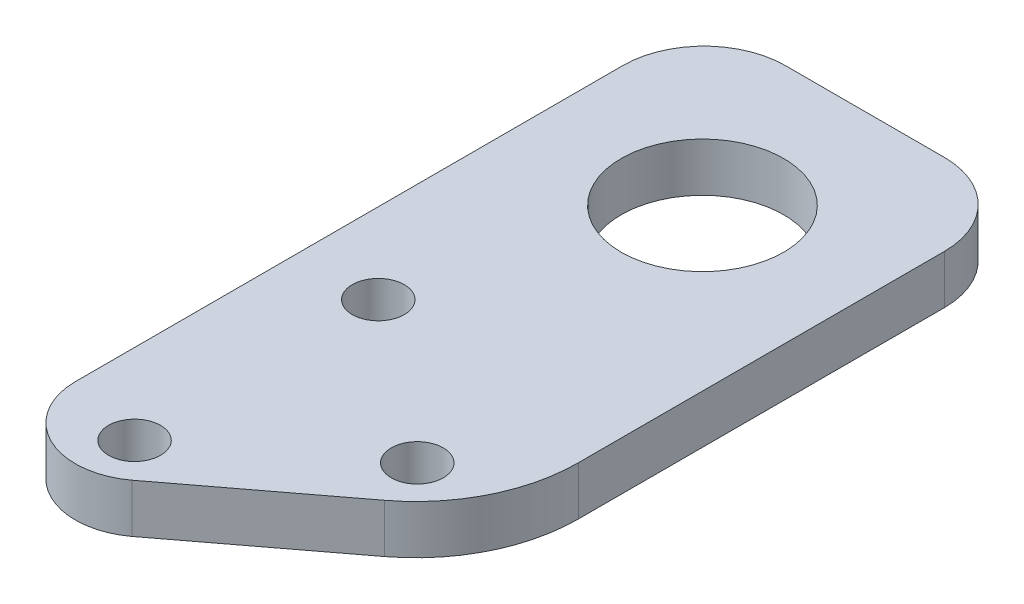
ISO-10303-21;
HEADER;
FILE_DESCRIPTION(('STEP AP214'),'2;1');
FILE_NAME('part.step','',(''),(''),'','','');
FILE_SCHEMA(('AUTOMOTIVE_DESIGN { 1 0 10303 214 1 1 1 1 }'));
ENDSEC;
DATA;
#1=APPLICATION_CONTEXT('core data for automotive mechanical design processes');
#2=APPLICATION_PROTOCOL_DEFINITION('international standard','automotive_design',2000,#1);
#3=PRODUCT_CONTEXT('',#1,'mechanical');
#4=PRODUCT('Part','Part','',(#3));
#5=PRODUCT_RELATED_PRODUCT_CATEGORY('part','',(#4));
#6=PRODUCT_DEFINITION_FORMATION('','',#4);
#7=PRODUCT_DEFINITION_CONTEXT('part definition',#1,'design');
#8=PRODUCT_DEFINITION('design','',#6,#7);
#9=PRODUCT_DEFINITION_SHAPE('','',#8);
#10=(LENGTH_UNIT() NAMED_UNIT(*) SI_UNIT(.MILLI.,.METRE.));
#11=(NAMED_UNIT(*) PLANE_ANGLE_UNIT() SI_UNIT($,.RADIAN.));
#12=(NAMED_UNIT(*) SI_UNIT($,.STERADIAN.) SOLID_ANGLE_UNIT());
#13=UNCERTAINTY_MEASURE_WITH_UNIT(LENGTH_MEASURE(1.E-05),#10,'distance_accuracy_value','');
#14=(GEOMETRIC_REPRESENTATION_CONTEXT(3) GLOBAL_UNCERTAINTY_ASSIGNED_CONTEXT((#13)) GLOBAL_UNIT_ASSIGNED_CONTEXT((#10,
#11,#12)) REPRESENTATION_CONTEXT('',''));
#15=CARTESIAN_POINT('',(0.,0.,0.));
#16=DIRECTION('',(0.,0.,1.));
#17=DIRECTION('',(1.,0.,0.));
#18=AXIS2_PLACEMENT_3D('',#15,#16,#17);
#19=CARTESIAN_POINT('',(-5.52258239011669,3.,6.19220157606207));
#20=DIRECTION('',(0.,1.,0.));
#21=DIRECTION('',(0.,0.,1.));
#22=AXIS2_PLACEMENT_3D('',#19,#20,#21);
#23=PLANE('',#22);
#24=CARTESIAN_POINT('',(4.95,3.,0.));
#25=DIRECTION('',(0.,1.,0.));
#26=DIRECTION('',(0.,0.,1.));
#27=AXIS2_PLACEMENT_3D('',#24,#25,#26);
#28=CIRCLE('',#27,1.6);
#29=CARTESIAN_POINT('',(4.95,3.,1.6));
#30=VERTEX_POINT('',#29);
#31=EDGE_CURVE('E223',#30,#30,#28,.T.);
#32=ORIENTED_EDGE('',*,*,#31,.F.);
#33=EDGE_LOOP('',(#32));
#34=FACE_BOUND('',#33,.T.);
#35=CARTESIAN_POINT('',(-4.95,3.,-7.5));
#36=DIRECTION('',(0.,1.,0.));
#37=DIRECTION('',(0.,0.,1.));
#38=AXIS2_PLACEMENT_3D('',#35,#36,#37);
#39=CIRCLE('',#38,1.6);
#40=CARTESIAN_POINT('',(-4.95,3.,-5.9));
#41=VERTEX_POINT('',#40);
#42=EDGE_CURVE('E148',#41,#41,#39,.T.);
#43=ORIENTED_EDGE('',*,*,#42,.F.);
#44=EDGE_LOOP('',(#43));
#45=FACE_BOUND('',#44,.T.);
#46=CARTESIAN_POINT('',(-5.52258239011669,3.,6.19220157606207));
#47=DIRECTION('',(0.,1.,0.));
#48=DIRECTION('',(0.,0.,1.));
#49=AXIS2_PLACEMENT_3D('',#46,#47,#48);
#50=CIRCLE('',#49,4.37741760988332);
#51=CARTESIAN_POINT('',(-9.9,3.,6.19220157606207));
#52=VERTEX_POINT('',#51);
#53=CARTESIAN_POINT('',(-2.90599709653165,3.,9.7015129519179));
#54=VERTEX_POINT('',#53);
#55=EDGE_CURVE('E166',#52,#54,#50,.T.);
#56=ORIENTED_EDGE('',*,*,#55,.T.);
#57=DIRECTION('',(0.797092148153991,0.,-0.603857687995488));
#58=VECTOR('',#57,1.);
#59=CARTESIAN_POINT('',(-2.90599709653165,3.,9.7015129519179));
#60=LINE('',#59,#58);
#61=CARTESIAN_POINT('',(5.93857687995438,3.,3.00107812124621));
#62=VERTEX_POINT('',#61);
#63=EDGE_CURVE('E102',#54,#62,#60,.T.);
#64=ORIENTED_EDGE('',*,*,#63,.T.);
#65=CARTESIAN_POINT('',(-0.100000000000503,3.,-4.9698433602937));
#66=DIRECTION('',(0.,1.,0.));
#67=DIRECTION('',(0.,0.,-1.));
#68=AXIS2_PLACEMENT_3D('',#65,#66,#67);
#69=CIRCLE('',#68,10.);
#70=CARTESIAN_POINT('',(9.8999999999995,3.,-4.9698433602937));
#71=VERTEX_POINT('',#70);
#72=EDGE_CURVE('E187',#62,#71,#69,.T.);
#73=ORIENTED_EDGE('',*,*,#72,.T.);
#74=DIRECTION('',(0.,0.,-1.));
#75=VECTOR('',#74,1.);
#76=CARTESIAN_POINT('',(9.8999999999995,3.,-27.5));
#77=LINE('',#76,#75);
#78=CARTESIAN_POINT('',(9.8999999999995,3.,-27.5));
#79=VERTEX_POINT('',#78);
#80=EDGE_CURVE('E201',#71,#79,#77,.T.);
#81=ORIENTED_EDGE('',*,*,#80,.T.);
#82=CARTESIAN_POINT('',(4.8999999999995,3.,-27.5));
#83=DIRECTION('',(0.,1.,0.));
#84=DIRECTION('',(0.,0.,1.));
#85=AXIS2_PLACEMENT_3D('',#82,#83,#84);
#86=CIRCLE('',#85,5.);
#87=CARTESIAN_POINT('',(4.89999999999946,3.,-32.5));
#88=VERTEX_POINT('',#87);
#89=EDGE_CURVE('E121',#79,#88,#86,.T.);
#90=ORIENTED_EDGE('',*,*,#89,.T.);
#91=DIRECTION('',(-1.,0.,0.));
#92=VECTOR('',#91,1.);
#93=CARTESIAN_POINT('',(4.89999999999946,3.,-32.5));
#94=LINE('',#93,#92);
#95=CARTESIAN_POINT('',(-4.89999999999996,3.,-32.5));
#96=VERTEX_POINT('',#95);
#97=EDGE_CURVE('E115',#88,#96,#94,.T.);
#98=ORIENTED_EDGE('',*,*,#97,.T.);
#99=CARTESIAN_POINT('',(-4.9,3.,-27.5));
#100=DIRECTION('',(0.,1.,0.));
#101=DIRECTION('',(0.,0.,-1.));
#102=AXIS2_PLACEMENT_3D('',#99,#100,#101);
#103=CIRCLE('',#102,5.);
#104=CARTESIAN_POINT('',(-9.9,3.,-27.5));
#105=VERTEX_POINT('',#104);
#106=EDGE_CURVE('E119',#96,#105,#103,.T.);
#107=ORIENTED_EDGE('',*,*,#106,.T.);
#108=DIRECTION('',(0.,0.,1.));
#109=VECTOR('',#108,1.);
#110=CARTESIAN_POINT('',(-9.9,3.,-27.5));
#111=LINE('',#110,#109);
#112=EDGE_CURVE('E59',#105,#52,#111,.T.);
#113=ORIENTED_EDGE('',*,*,#112,.T.);
#114=EDGE_LOOP('',(#56,#64,#73,#81,#90,#98,#107,#113));
#115=FACE_BOUND('',#114,.T.);
#116=CARTESIAN_POINT('',(-4.95000000000002,3.,7.49999999999996));
#117=DIRECTION('',(0.,1.,0.));
#118=DIRECTION('',(0.,0.,1.));
#119=AXIS2_PLACEMENT_3D('',#116,#117,#118);
#120=CIRCLE('',#119,1.6);
#121=CARTESIAN_POINT('',(-4.95000000000002,3.,9.09999999999996));
#122=VERTEX_POINT('',#121);
#123=EDGE_CURVE('E215',#122,#122,#120,.T.);
#124=ORIENTED_EDGE('',*,*,#123,.F.);
#125=EDGE_LOOP('',(#124));
#126=FACE_BOUND('',#125,.T.);
#127=CARTESIAN_POINT('',(-2.51534904016637E-13,3.,-22.5));
#128=DIRECTION('',(0.,1.,0.));
#129=DIRECTION('',(0.,0.,1.));
#130=AXIS2_PLACEMENT_3D('',#127,#128,#129);
#131=CIRCLE('',#130,5.);
#132=CARTESIAN_POINT('',(-2.51534904016637E-13,3.,-17.5));
#133=VERTEX_POINT('',#132);
#134=EDGE_CURVE('E231',#133,#133,#131,.T.);
#135=ORIENTED_EDGE('',*,*,#134,.F.);
#136=EDGE_LOOP('',(#135));
#137=FACE_BOUND('',#136,.T.);
#138=ADVANCED_FACE('F41',(#34,#45,#115,#126,#137),#23,.T.);
#139=CARTESIAN_POINT('',(-5.52258239011669,0.,6.19220157606207));
#140=DIRECTION('',(0.,1.,0.));
#141=DIRECTION('',(0.,0.,1.));
#142=AXIS2_PLACEMENT_3D('',#139,#140,#141);
#143=PLANE('',#142);
#144=CARTESIAN_POINT('',(-5.52258239011669,0.,6.19220157606207));
#145=DIRECTION('',(0.,1.,0.));
#146=DIRECTION('',(0.,0.,1.));
#147=AXIS2_PLACEMENT_3D('',#144,#145,#146);
#148=CIRCLE('',#147,4.37741760988332);
#149=CARTESIAN_POINT('',(-9.9,0.,6.19220157606207));
#150=VERTEX_POINT('',#149);
#151=CARTESIAN_POINT('',(-2.90599709653165,0.,9.7015129519179));
#152=VERTEX_POINT('',#151);
#153=EDGE_CURVE('E143',#150,#152,#148,.T.);
#154=ORIENTED_EDGE('',*,*,#153,.F.);
#155=DIRECTION('',(0.,0.,1.));
#156=VECTOR('',#155,1.);
#157=CARTESIAN_POINT('',(-9.9,0.,-27.5));
#158=LINE('',#157,#156);
#159=CARTESIAN_POINT('',(-9.9,0.,-27.5));
#160=VERTEX_POINT('',#159);
#161=EDGE_CURVE('E94',#160,#150,#158,.T.);
#162=ORIENTED_EDGE('',*,*,#161,.F.);
#163=CARTESIAN_POINT('',(-4.9,0.,-27.5));
#164=DIRECTION('',(0.,1.,0.));
#165=DIRECTION('',(0.,0.,-1.));
#166=AXIS2_PLACEMENT_3D('',#163,#164,#165);
#167=CIRCLE('',#166,5.);
#168=CARTESIAN_POINT('',(-4.89999999999996,0.,-32.5));
#169=VERTEX_POINT('',#168);
#170=EDGE_CURVE('E88',#169,#160,#167,.T.);
#171=ORIENTED_EDGE('',*,*,#170,.F.);
#172=DIRECTION('',(-1.,0.,0.));
#173=VECTOR('',#172,1.);
#174=CARTESIAN_POINT('',(4.89999999999946,0.,-32.5));
#175=LINE('',#174,#173);
#176=CARTESIAN_POINT('',(4.89999999999946,0.,-32.5));
#177=VERTEX_POINT('',#176);
#178=EDGE_CURVE('E130',#177,#169,#175,.T.);
#179=ORIENTED_EDGE('',*,*,#178,.F.);
#180=CARTESIAN_POINT('',(4.8999999999995,0.,-27.5));
#181=DIRECTION('',(0.,1.,0.));
#182=DIRECTION('',(0.,0.,1.));
#183=AXIS2_PLACEMENT_3D('',#180,#181,#182);
#184=CIRCLE('',#183,5.);
#185=CARTESIAN_POINT('',(9.8999999999995,0.,-27.5));
#186=VERTEX_POINT('',#185);
#187=EDGE_CURVE('E157',#186,#177,#184,.T.);
#188=ORIENTED_EDGE('',*,*,#187,.F.);
#189=DIRECTION('',(0.,0.,-1.));
#190=VECTOR('',#189,1.);
#191=CARTESIAN_POINT('',(9.8999999999995,0.,-27.5));
#192=LINE('',#191,#190);
#193=CARTESIAN_POINT('',(9.8999999999995,0.,-4.9698433602937));
#194=VERTEX_POINT('',#193);
#195=EDGE_CURVE('E154',#194,#186,#192,.T.);
#196=ORIENTED_EDGE('',*,*,#195,.F.);
#197=CARTESIAN_POINT('',(-0.100000000000503,0.,-4.9698433602937));
#198=DIRECTION('',(0.,1.,0.));
#199=DIRECTION('',(0.,0.,-1.));
#200=AXIS2_PLACEMENT_3D('',#197,#198,#199);
#201=CIRCLE('',#200,10.);
#202=CARTESIAN_POINT('',(5.93857687995438,0.,3.00107812124621));
#203=VERTEX_POINT('',#202);
#204=EDGE_CURVE('E151',#203,#194,#201,.T.);
#205=ORIENTED_EDGE('',*,*,#204,.F.);
#206=DIRECTION('',(0.797092148153991,0.,-0.603857687995488));
#207=VECTOR('',#206,1.);
#208=CARTESIAN_POINT('',(-2.90599709653165,0.,9.7015129519179));
#209=LINE('',#208,#207);
#210=EDGE_CURVE('E147',#152,#203,#209,.T.);
#211=ORIENTED_EDGE('',*,*,#210,.F.);
#212=EDGE_LOOP('',(#154,#162,#171,#179,#188,#196,#205,#211));
#213=FACE_BOUND('',#212,.T.);
#214=CARTESIAN_POINT('',(-4.95,0.,-7.5));
#215=DIRECTION('',(0.,1.,0.));
#216=DIRECTION('',(0.,0.,1.));
#217=AXIS2_PLACEMENT_3D('',#214,#215,#216);
#218=CIRCLE('',#217,1.6);
#219=CARTESIAN_POINT('',(-4.95,0.,-5.9));
#220=VERTEX_POINT('',#219);
#221=EDGE_CURVE('E211',#220,#220,#218,.T.);
#222=ORIENTED_EDGE('',*,*,#221,.T.);
#223=EDGE_LOOP('',(#222));
#224=FACE_BOUND('',#223,.T.);
#225=CARTESIAN_POINT('',(-4.95000000000002,0.,7.49999999999996));
#226=DIRECTION('',(0.,1.,0.));
#227=DIRECTION('',(0.,0.,1.));
#228=AXIS2_PLACEMENT_3D('',#225,#226,#227);
#229=CIRCLE('',#228,1.6);
#230=CARTESIAN_POINT('',(-4.95000000000002,0.,9.09999999999996));
#231=VERTEX_POINT('',#230);
#232=EDGE_CURVE('E219',#231,#231,#229,.T.);
#233=ORIENTED_EDGE('',*,*,#232,.T.);
#234=EDGE_LOOP('',(#233));
#235=FACE_BOUND('',#234,.T.);
#236=CARTESIAN_POINT('',(4.95,0.,0.));
#237=DIRECTION('',(0.,1.,0.));
#238=DIRECTION('',(0.,0.,1.));
#239=AXIS2_PLACEMENT_3D('',#236,#237,#238);
#240=CIRCLE('',#239,1.6);
#241=CARTESIAN_POINT('',(4.95,0.,1.6));
#242=VERTEX_POINT('',#241);
#243=EDGE_CURVE('E227',#242,#242,#240,.T.);
#244=ORIENTED_EDGE('',*,*,#243,.T.);
#245=EDGE_LOOP('',(#244));
#246=FACE_BOUND('',#245,.T.);
#247=CARTESIAN_POINT('',(-2.51534904016637E-13,0.,-22.5));
#248=DIRECTION('',(0.,1.,0.));
#249=DIRECTION('',(0.,0.,1.));
#250=AXIS2_PLACEMENT_3D('',#247,#248,#249);
#251=CIRCLE('',#250,5.);
#252=CARTESIAN_POINT('',(-2.51534904016637E-13,0.,-17.5));
#253=VERTEX_POINT('',#252);
#254=EDGE_CURVE('E235',#253,#253,#251,.T.);
#255=ORIENTED_EDGE('',*,*,#254,.T.);
#256=EDGE_LOOP('',(#255));
#257=FACE_BOUND('',#256,.T.);
#258=ADVANCED_FACE('F191',(#213,#224,#235,#246,#257),#143,.F.);
#259=CARTESIAN_POINT('',(-5.52258239011669,3.,6.19220157606207));
#260=DIRECTION('',(0.,-1.,0.));
#261=DIRECTION('',(0.,0.,-1.));
#262=AXIS2_PLACEMENT_3D('',#259,#260,#261);
#263=CYLINDRICAL_SURFACE('',#262,4.37741760988332);
#264=ORIENTED_EDGE('',*,*,#153,.T.);
#265=DIRECTION('',(0.,-1.,0.));
#266=VECTOR('',#265,1.);
#267=CARTESIAN_POINT('',(-2.90599709653165,3.,9.7015129519179));
#268=LINE('',#267,#266);
#269=EDGE_CURVE('E11',#54,#152,#268,.T.);
#270=ORIENTED_EDGE('',*,*,#269,.F.);
#271=ORIENTED_EDGE('',*,*,#55,.F.);
#272=DIRECTION('',(0.,-1.,0.));
#273=VECTOR('',#272,1.);
#274=CARTESIAN_POINT('',(-9.9,3.,6.19220157606207));
#275=LINE('',#274,#273);
#276=EDGE_CURVE('E139',#52,#150,#275,.T.);
#277=ORIENTED_EDGE('',*,*,#276,.T.);
#278=EDGE_LOOP('',(#264,#270,#271,#277));
#279=FACE_BOUND('',#278,.T.);
#280=ADVANCED_FACE('F43',(#279),#263,.T.);
#281=CARTESIAN_POINT('',(-2.90599709653165,3.,9.7015129519179));
#282=DIRECTION('',(-0.603857687995488,0.,-0.797092148153991));
#283=DIRECTION('',(-0.797092148153991,0.,0.603857687995488));
#284=AXIS2_PLACEMENT_3D('',#281,#282,#283);
#285=PLANE('',#284);
#286=ORIENTED_EDGE('',*,*,#210,.T.);
#287=DIRECTION('',(0.,-1.,0.));
#288=VECTOR('',#287,1.);
#289=CARTESIAN_POINT('',(5.93857687995438,3.,3.00107812124621));
#290=LINE('',#289,#288);
#291=EDGE_CURVE('E51',#62,#203,#290,.T.);
#292=ORIENTED_EDGE('',*,*,#291,.F.);
#293=ORIENTED_EDGE('',*,*,#63,.F.);
#294=ORIENTED_EDGE('',*,*,#269,.T.);
#295=EDGE_LOOP('',(#286,#292,#293,#294));
#296=FACE_BOUND('',#295,.T.);
#297=ADVANCED_FACE('F271',(#296),#285,.F.);
#298=CARTESIAN_POINT('',(-0.100000000000503,3.,-4.9698433602937));
#299=DIRECTION('',(0.,-1.,0.));
#300=DIRECTION('',(0.,0.,-1.));
#301=AXIS2_PLACEMENT_3D('',#298,#299,#300);
#302=CYLINDRICAL_SURFACE('',#301,10.);
#303=ORIENTED_EDGE('',*,*,#204,.T.);
#304=DIRECTION('',(0.,-1.,0.));
#305=VECTOR('',#304,1.);
#306=CARTESIAN_POINT('',(9.8999999999995,3.,-4.9698433602937));
#307=LINE('',#306,#305);
#308=EDGE_CURVE('E177',#71,#194,#307,.T.);
#309=ORIENTED_EDGE('',*,*,#308,.F.);
#310=ORIENTED_EDGE('',*,*,#72,.F.);
#311=ORIENTED_EDGE('',*,*,#291,.T.);
#312=EDGE_LOOP('',(#303,#309,#310,#311));
#313=FACE_BOUND('',#312,.T.);
#314=ADVANCED_FACE('F185',(#313),#302,.T.);
#315=CARTESIAN_POINT('',(9.8999999999995,3.,-27.5));
#316=DIRECTION('',(-1.,0.,0.));
#317=DIRECTION('',(0.,0.,1.));
#318=AXIS2_PLACEMENT_3D('',#315,#316,#317);
#319=PLANE('',#318);
#320=ORIENTED_EDGE('',*,*,#195,.T.);
#321=DIRECTION('',(0.,-1.,0.));
#322=VECTOR('',#321,1.);
#323=CARTESIAN_POINT('',(9.8999999999995,3.,-27.5));
#324=LINE('',#323,#322);
#325=EDGE_CURVE('E173',#79,#186,#324,.T.);
#326=ORIENTED_EDGE('',*,*,#325,.F.);
#327=ORIENTED_EDGE('',*,*,#80,.F.);
#328=ORIENTED_EDGE('',*,*,#308,.T.);
#329=EDGE_LOOP('',(#320,#326,#327,#328));
#330=FACE_BOUND('',#329,.T.);
#331=ADVANCED_FACE('F196',(#330),#319,.F.);
#332=CARTESIAN_POINT('',(4.8999999999995,3.,-27.5));
#333=DIRECTION('',(0.,-1.,0.));
#334=DIRECTION('',(0.,0.,-1.));
#335=AXIS2_PLACEMENT_3D('',#332,#333,#334);
#336=CYLINDRICAL_SURFACE('',#335,5.);
#337=ORIENTED_EDGE('',*,*,#187,.T.);
#338=DIRECTION('',(0.,-1.,0.));
#339=VECTOR('',#338,1.);
#340=CARTESIAN_POINT('',(4.89999999999946,3.,-32.5));
#341=LINE('',#340,#339);
#342=EDGE_CURVE('E132',#88,#177,#341,.T.);
#343=ORIENTED_EDGE('',*,*,#342,.F.);
#344=ORIENTED_EDGE('',*,*,#89,.F.);
#345=ORIENTED_EDGE('',*,*,#325,.T.);
#346=EDGE_LOOP('',(#337,#343,#344,#345));
#347=FACE_BOUND('',#346,.T.);
#348=ADVANCED_FACE('F199',(#347),#336,.T.);
#349=CARTESIAN_POINT('',(4.89999999999946,3.,-32.5));
#350=DIRECTION('',(0.,0.,1.));
#351=DIRECTION('',(1.,0.,0.));
#352=AXIS2_PLACEMENT_3D('',#349,#350,#351);
#353=PLANE('',#352);
#354=ORIENTED_EDGE('',*,*,#178,.T.);
#355=DIRECTION('',(0.,-1.,0.));
#356=VECTOR('',#355,1.);
#357=CARTESIAN_POINT('',(-4.89999999999996,3.,-32.5));
#358=LINE('',#357,#356);
#359=EDGE_CURVE('E127',#96,#169,#358,.T.);
#360=ORIENTED_EDGE('',*,*,#359,.F.);
#361=ORIENTED_EDGE('',*,*,#97,.F.);
#362=ORIENTED_EDGE('',*,*,#342,.T.);
#363=EDGE_LOOP('',(#354,#360,#361,#362));
#364=FACE_BOUND('',#363,.T.);
#365=ADVANCED_FACE('F128',(#364),#353,.F.);
#366=CARTESIAN_POINT('',(-4.9,3.,-27.5));
#367=DIRECTION('',(0.,-1.,0.));
#368=DIRECTION('',(0.,0.,-1.));
#369=AXIS2_PLACEMENT_3D('',#366,#367,#368);
#370=CYLINDRICAL_SURFACE('',#369,5.);
#371=ORIENTED_EDGE('',*,*,#170,.T.);
#372=DIRECTION('',(0.,-1.,0.));
#373=VECTOR('',#372,1.);
#374=CARTESIAN_POINT('',(-9.9,3.,-27.5));
#375=LINE('',#374,#373);
#376=EDGE_CURVE('E133',#105,#160,#375,.T.);
#377=ORIENTED_EDGE('',*,*,#376,.F.);
#378=ORIENTED_EDGE('',*,*,#106,.F.);
#379=ORIENTED_EDGE('',*,*,#359,.T.);
#380=EDGE_LOOP('',(#371,#377,#378,#379));
#381=FACE_BOUND('',#380,.T.);
#382=ADVANCED_FACE('F135',(#381),#370,.T.);
#383=CARTESIAN_POINT('',(-9.9,3.,-27.5));
#384=DIRECTION('',(1.,0.,0.));
#385=DIRECTION('',(0.,0.,-1.));
#386=AXIS2_PLACEMENT_3D('',#383,#384,#385);
#387=PLANE('',#386);
#388=ORIENTED_EDGE('',*,*,#161,.T.);
#389=ORIENTED_EDGE('',*,*,#276,.F.);
#390=ORIENTED_EDGE('',*,*,#112,.F.);
#391=ORIENTED_EDGE('',*,*,#376,.T.);
#392=EDGE_LOOP('',(#388,#389,#390,#391));
#393=FACE_BOUND('',#392,.T.);
#394=ADVANCED_FACE('F259',(#393),#387,.F.);
#395=CARTESIAN_POINT('',(-4.95,3.,-7.5));
#396=DIRECTION('',(0.,-1.,0.));
#397=DIRECTION('',(0.,0.,-1.));
#398=AXIS2_PLACEMENT_3D('',#395,#396,#397);
#399=CYLINDRICAL_SURFACE('',#398,1.6);
#400=ORIENTED_EDGE('',*,*,#42,.T.);
#401=EDGE_LOOP('',(#400));
#402=FACE_BOUND('',#401,.T.);
#403=ORIENTED_EDGE('',*,*,#221,.F.);
#404=EDGE_LOOP('',(#403));
#405=FACE_BOUND('',#404,.T.);
#406=ADVANCED_FACE('F256',(#402,#405),#399,.F.);
#407=CARTESIAN_POINT('',(-4.95000000000002,3.,7.49999999999996));
#408=DIRECTION('',(0.,-1.,0.));
#409=DIRECTION('',(0.,0.,-1.));
#410=AXIS2_PLACEMENT_3D('',#407,#408,#409);
#411=CYLINDRICAL_SURFACE('',#410,1.6);
#412=ORIENTED_EDGE('',*,*,#123,.T.);
#413=EDGE_LOOP('',(#412));
#414=FACE_BOUND('',#413,.T.);
#415=ORIENTED_EDGE('',*,*,#232,.F.);
#416=EDGE_LOOP('',(#415));
#417=FACE_BOUND('',#416,.T.);
#418=ADVANCED_FACE('F347',(#414,#417),#411,.F.);
#419=CARTESIAN_POINT('',(4.95,3.,0.));
#420=DIRECTION('',(0.,-1.,0.));
#421=DIRECTION('',(0.,0.,-1.));
#422=AXIS2_PLACEMENT_3D('',#419,#420,#421);
#423=CYLINDRICAL_SURFACE('',#422,1.6);
#424=ORIENTED_EDGE('',*,*,#31,.T.);
#425=EDGE_LOOP('',(#424));
#426=FACE_BOUND('',#425,.T.);
#427=ORIENTED_EDGE('',*,*,#243,.F.);
#428=EDGE_LOOP('',(#427));
#429=FACE_BOUND('',#428,.T.);
#430=ADVANCED_FACE('F356',(#426,#429),#423,.F.);
#431=CARTESIAN_POINT('',(-2.51534904016637E-13,3.,-22.5));
#432=DIRECTION('',(0.,-1.,0.));
#433=DIRECTION('',(0.,0.,-1.));
#434=AXIS2_PLACEMENT_3D('',#431,#432,#433);
#435=CYLINDRICAL_SURFACE('',#434,5.);
#436=ORIENTED_EDGE('',*,*,#134,.T.);
#437=EDGE_LOOP('',(#436));
#438=FACE_BOUND('',#437,.T.);
#439=ORIENTED_EDGE('',*,*,#254,.F.);
#440=EDGE_LOOP('',(#439));
#441=FACE_BOUND('',#440,.T.);
#442=ADVANCED_FACE('F243',(#438,#441),#435,.F.);
#443=CLOSED_SHELL('',(#138,#258,#280,#297,#314,#331,#348,#365,#382,#394,#406,#418,#430,#442));
#444=MANIFOLD_SOLID_BREP('B2',#443);
#445=ADVANCED_BREP_SHAPE_REPRESENTATION('',(#18,#444),#14);
#446=SHAPE_DEFINITION_REPRESENTATION(#9,#445);
ENDSEC;
END-ISO-10303-21;
